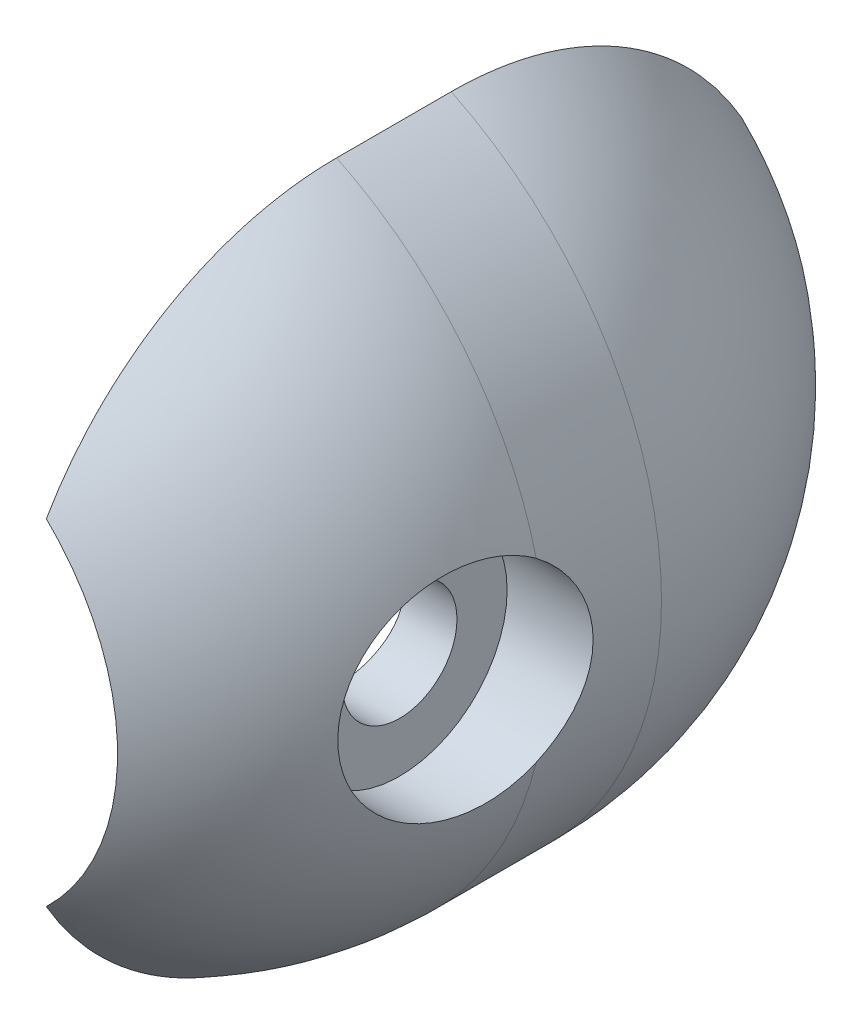
ISO-10303-21;
HEADER;
FILE_DESCRIPTION(('STEP AP214'),'2;1');
FILE_NAME('part.step','',(''),(''),'','','');
FILE_SCHEMA(('AUTOMOTIVE_DESIGN { 1 0 10303 214 1 1 1 1 }'));
ENDSEC;
DATA;
#1=APPLICATION_CONTEXT('core data for automotive mechanical design processes');
#2=APPLICATION_PROTOCOL_DEFINITION('international standard','automotive_design',2000,#1);
#3=PRODUCT_CONTEXT('',#1,'mechanical');
#4=PRODUCT('Part','Part','',(#3));
#5=PRODUCT_RELATED_PRODUCT_CATEGORY('part','',(#4));
#6=PRODUCT_DEFINITION_FORMATION('','',#4);
#7=PRODUCT_DEFINITION_CONTEXT('part definition',#1,'design');
#8=PRODUCT_DEFINITION('design','',#6,#7);
#9=PRODUCT_DEFINITION_SHAPE('','',#8);
#10=(LENGTH_UNIT() NAMED_UNIT(*) SI_UNIT(.MILLI.,.METRE.));
#11=(NAMED_UNIT(*) PLANE_ANGLE_UNIT() SI_UNIT($,.RADIAN.));
#12=(NAMED_UNIT(*) SI_UNIT($,.STERADIAN.) SOLID_ANGLE_UNIT());
#13=UNCERTAINTY_MEASURE_WITH_UNIT(LENGTH_MEASURE(1.E-05),#10,'distance_accuracy_value','');
#14=(GEOMETRIC_REPRESENTATION_CONTEXT(3) GLOBAL_UNCERTAINTY_ASSIGNED_CONTEXT((#13)) GLOBAL_UNIT_ASSIGNED_CONTEXT((#10,
#11,#12)) REPRESENTATION_CONTEXT('',''));
#15=CARTESIAN_POINT('',(0.,0.,0.));
#16=DIRECTION('',(0.,0.,1.));
#17=DIRECTION('',(1.,0.,0.));
#18=AXIS2_PLACEMENT_3D('',#15,#16,#17);
#19=CARTESIAN_POINT('',(0.,0.,-2.));
#20=DIRECTION('',(0.,0.,1.));
#21=DIRECTION('',(1.,0.,0.));
#22=AXIS2_PLACEMENT_3D('',#19,#20,#21);
#23=CYLINDRICAL_SURFACE('',#22,6.5);
#24=CARTESIAN_POINT('',(0.,0.,-2.));
#25=DIRECTION('',(0.,0.,-1.));
#26=DIRECTION('',(-1.,0.,0.));
#27=AXIS2_PLACEMENT_3D('',#24,#25,#26);
#28=CIRCLE('',#27,6.5);
#29=CARTESIAN_POINT('',(2.83218300017888,5.85053326231873,-1.99999999999998));
#30=VERTEX_POINT('',#29);
#31=CARTESIAN_POINT('',(2.83218300017888,-5.85053326231873,-1.99999999999998));
#32=VERTEX_POINT('',#31);
#33=EDGE_CURVE('E91',#30,#32,#28,.T.);
#34=ORIENTED_EDGE('',*,*,#33,.F.);
#35=DIRECTION('',(0.,0.,1.));
#36=VECTOR('',#35,1.);
#37=CARTESIAN_POINT('',(2.83218300017888,5.85053326231873,-2.));
#38=LINE('',#37,#36);
#39=CARTESIAN_POINT('',(2.83218300017887,5.85053326231873,0.));
#40=VERTEX_POINT('',#39);
#41=EDGE_CURVE('E51',#30,#40,#38,.T.);
#42=ORIENTED_EDGE('',*,*,#41,.T.);
#43=CARTESIAN_POINT('',(0.,0.,0.));
#44=DIRECTION('',(0.,0.,-1.));
#45=DIRECTION('',(-1.,0.,0.));
#46=AXIS2_PLACEMENT_3D('',#43,#44,#45);
#47=CIRCLE('',#46,6.5);
#48=CARTESIAN_POINT('',(6.31461700155021,1.54130208711114,0.));
#49=VERTEX_POINT('',#48);
#50=EDGE_CURVE('E101',#40,#49,#47,.T.);
#51=ORIENTED_EDGE('',*,*,#50,.T.);
#52=CARTESIAN_POINT('',(6.31461700155021,1.54130208711114,0.));
#53=CARTESIAN_POINT('',(6.32198857908574,1.51109698103046,-0.0435994876451644));
#54=CARTESIAN_POINT('',(6.32957540148589,1.47907659404713,-0.0858713829253989));
#55=CARTESIAN_POINT('',(6.34496637043963,1.41159648900797,-0.167530981875031));
#56=CARTESIAN_POINT('',(6.35277051299768,1.37613683415506,-0.206918738522475));
#57=CARTESIAN_POINT('',(6.37619220507379,1.26487169735636,-0.320427223621003));
#58=CARTESIAN_POINT('',(6.39181642522165,1.18419021713728,-0.38987851244404));
#59=CARTESIAN_POINT('',(6.42132898699378,1.01201210713663,-0.514298255521196));
#60=CARTESIAN_POINT('',(6.43521590790943,0.920506743351564,-0.569254896682479));
#61=CARTESIAN_POINT('',(6.45968219470522,0.729221433979638,-0.66294222507686));
#62=CARTESIAN_POINT('',(6.47026589895835,0.629452561419527,-0.701694218081978));
#63=CARTESIAN_POINT('',(6.48554087644084,0.441697257129723,-0.756685972032372));
#64=CARTESIAN_POINT('',(6.49092302589285,0.354544113565269,-0.775612679766259));
#65=CARTESIAN_POINT('',(6.49815360593029,0.178267534090456,-0.800914856042572));
#66=CARTESIAN_POINT('',(6.50000145917355,0.089143778677268,-0.807288273957262));
#67=CARTESIAN_POINT('',(6.49999831339637,-0.103037931239378,-0.807283684109613));
#68=CARTESIAN_POINT('',(6.49752591283835,-0.206102613912167,-0.798763380310864));
#69=CARTESIAN_POINT('',(6.48790294183109,-0.409232637572165,-0.764979429276356));
#70=CARTESIAN_POINT('',(6.48075090243528,-0.509297026443797,-0.739710524593954));
#71=CARTESIAN_POINT('',(6.46255614337027,-0.703469529260469,-0.673339932177493));
#72=CARTESIAN_POINT('',(6.45151916567931,-0.797586193155803,-0.632261602612253));
#73=CARTESIAN_POINT('',(6.42670450373198,-0.977619468327088,-0.535512900806938));
#74=CARTESIAN_POINT('',(6.41292602506288,-1.06353369205433,-0.479838297473228));
#75=CARTESIAN_POINT('',(6.38481462979937,-1.22072827422579,-0.358734233247323));
#76=CARTESIAN_POINT('',(6.37055018947306,-1.292543952299,-0.293981177312349));
#77=CARTESIAN_POINT('',(6.34215720405847,-1.42537265373043,-0.154276324129979));
#78=CARTESIAN_POINT('',(6.32802856937644,-1.48639333843161,-0.0793318272324476));
#79=CARTESIAN_POINT('',(6.31461700155021,-1.54130208711113,0.));
#80=B_SPLINE_CURVE_WITH_KNOTS('',3,(#52,#53,#54,#55,#56,#57,#58,#59,#60,#61,#62,#63,#64,#65,#66,
#67,#68,#69,#70,#71,#72,#73,#74,#75,#76,#77,#78,#79),.UNSPECIFIED.,.F.,.F.,(4,2,2,2,2,2,2,2,2,2,
2,2,2,4),(0.,0.160548845477456,0.321094741131677,0.642239936845833,0.963646061734351,
1.2846282649313,1.55173182664302,1.81887901712204,2.12766437771378,2.43654671308545,
2.74497442104067,3.05349163349524,3.34559820878922,3.6374966333292),.UNSPECIFIED.);
#81=CARTESIAN_POINT('',(6.31461700155021,-1.54130208711114,0.));
#82=VERTEX_POINT('',#81);
#83=EDGE_CURVE('E113',#49,#82,#80,.T.);
#84=ORIENTED_EDGE('',*,*,#83,.T.);
#85=CARTESIAN_POINT('',(2.83218300017887,-5.85053326231873,0.));
#86=VERTEX_POINT('',#85);
#87=EDGE_CURVE('E94',#82,#86,#47,.T.);
#88=ORIENTED_EDGE('',*,*,#87,.T.);
#89=DIRECTION('',(0.,0.,1.));
#90=VECTOR('',#89,1.);
#91=CARTESIAN_POINT('',(2.83218300017888,-5.85053326231873,-2.));
#92=LINE('',#91,#90);
#93=EDGE_CURVE('E81',#86,#32,#92,.F.);
#94=ORIENTED_EDGE('',*,*,#93,.T.);
#95=EDGE_LOOP('',(#34,#42,#51,#84,#88,#94));
#96=FACE_BOUND('',#95,.T.);
#97=ADVANCED_FACE('F35',(#96),#23,.T.);
#98=CARTESIAN_POINT('',(2.5,0.,1.06771385505056));
#99=DIRECTION('',(1.,0.,0.));
#100=DIRECTION('',(0.,0.,-1.));
#101=AXIS2_PLACEMENT_3D('',#98,#99,#100);
#102=CYLINDRICAL_SURFACE('',#101,1.);
#103=CARTESIAN_POINT('',(4.075,0.,0.067713855050556));
#104=CARTESIAN_POINT('',(4.07499904475018,0.0552835301018704,0.0677154645149668));
#105=CARTESIAN_POINT('',(4.07386374935255,0.110585249922706,0.0723136909456335));
#106=CARTESIAN_POINT('',(4.06944477976684,0.219605916835804,0.0905588749120229));
#107=CARTESIAN_POINT('',(4.06615983891691,0.273323911215019,0.104211167549513));
#108=CARTESIAN_POINT('',(4.05780564539782,0.377586842868677,0.140101740474629));
#109=CARTESIAN_POINT('',(4.05273849353395,0.428135433816925,0.162329914803333));
#110=CARTESIAN_POINT('',(4.04136064399071,0.524785943961525,0.214706243955371));
#111=CARTESIAN_POINT('',(4.0350499155306,0.570887753049979,0.244854594823421));
#112=CARTESIAN_POINT('',(4.02173059298236,0.658253629579914,0.312849306866738));
#113=CARTESIAN_POINT('',(4.01471154881566,0.699416600507309,0.350823526475008));
#114=CARTESIAN_POINT('',(4.0008367452954,0.774857982591311,0.433118166780281));
#115=CARTESIAN_POINT('',(3.99398100380471,0.80913564361893,0.477439278047578));
#116=CARTESIAN_POINT('',(3.98110406600606,0.870304268925302,0.571948750054729));
#117=CARTESIAN_POINT('',(3.97509615667387,0.897082991455841,0.622211730600353));
#118=CARTESIAN_POINT('',(3.96474717054754,0.941772071687814,0.726697030495582));
#119=CARTESIAN_POINT('',(3.9604058379414,0.959683790556507,0.780918740676171));
#120=CARTESIAN_POINT('',(3.95398881132489,0.985787189597801,0.890672916500155));
#121=CARTESIAN_POINT('',(3.95187090727802,0.994160226268956,0.946159724636663));
#122=CARTESIAN_POINT('',(3.9500141248854,1.00151333263062,1.05778777165738));
#123=CARTESIAN_POINT('',(3.95027487446489,1.00049487136165,1.11392890681809));
#124=CARTESIAN_POINT('',(3.95310795249312,0.98923878083042,1.22388862736974));
#125=CARTESIAN_POINT('',(3.95562630810271,0.979216397414509,1.27773085330313));
#126=CARTESIAN_POINT('',(3.96260493516141,0.950579960761466,1.38294538469551));
#127=CARTESIAN_POINT('',(3.96706534044611,0.931965315386612,1.43431751965814));
#128=CARTESIAN_POINT('',(3.97747559069128,0.886487155417108,1.53371508048623));
#129=CARTESIAN_POINT('',(3.98343956470394,0.859544809406126,1.58170289612285));
#130=CARTESIAN_POINT('',(3.99617688254056,0.798231217391749,1.67255395434461));
#131=CARTESIAN_POINT('',(4.00295036313516,0.763858715226451,1.71541632850355));
#132=CARTESIAN_POINT('',(4.01677142420201,0.687541771059452,1.79603422075633));
#133=CARTESIAN_POINT('',(4.02382142634195,0.645415464104054,1.83361737030412));
#134=CARTESIAN_POINT('',(4.03723334707441,0.555374251204761,1.90121774868632));
#135=CARTESIAN_POINT('',(4.04359524612703,0.507459180960462,1.93123476269914));
#136=CARTESIAN_POINT('',(4.05494395884058,0.406960170642944,1.98291082192826));
#137=CARTESIAN_POINT('',(4.05992629007302,0.354361728438865,2.00454271155107));
#138=CARTESIAN_POINT('',(4.0679218145329,0.246125732302644,2.03861003377043));
#139=CARTESIAN_POINT('',(4.07093537029248,0.190488739937717,2.05104715955487));
#140=CARTESIAN_POINT('',(4.07460046451808,0.0792294279390113,2.06611061893912));
#141=CARTESIAN_POINT('',(4.07530853028364,0.0236407191300542,2.0689717911206));
#142=CARTESIAN_POINT('',(4.07444346237016,-0.0872210490107458,2.06544504895129));
#143=CARTESIAN_POINT('',(4.07287052606975,-0.142494135238414,2.05905793486909));
#144=CARTESIAN_POINT('',(4.06765633361633,-0.250345483336205,2.03740971041497));
#145=CARTESIAN_POINT('',(4.06404477700803,-0.302950872960277,2.02227595112608));
#146=CARTESIAN_POINT('',(4.0551598540691,-0.404874076895213,1.98370885260416));
#147=CARTESIAN_POINT('',(4.04988632353918,-0.454191565785354,1.96027469328192));
#148=CARTESIAN_POINT('',(4.03812633172316,-0.549079104527889,1.90531163546201));
#149=CARTESIAN_POINT('',(4.03162053490662,-0.594569932821025,1.87365020530905));
#150=CARTESIAN_POINT('',(4.01814941968771,-0.679676385489599,1.80330153009682));
#151=CARTESIAN_POINT('',(4.01118402515304,-0.719291032928664,1.76461311914957));
#152=CARTESIAN_POINT('',(3.99737651663293,-0.792482408614201,1.68022007605867));
#153=CARTESIAN_POINT('',(3.99054118482852,-0.825894695171926,1.63437148578334));
#154=CARTESIAN_POINT('',(3.97795170826798,-0.884549988034678,1.53757876905249));
#155=CARTESIAN_POINT('',(3.97219751522239,-0.909793359243654,1.48663487033659));
#156=CARTESIAN_POINT('',(3.96248421676639,-0.951207928156029,1.38137343785624));
#157=CARTESIAN_POINT('',(3.95851450875033,-0.967432849455995,1.32707807048914));
#158=CARTESIAN_POINT('',(3.95280777059345,-0.990494576318383,1.21641850147068));
#159=CARTESIAN_POINT('',(3.95107027330792,-0.997333346183197,1.16005473522278));
#160=CARTESIAN_POINT('',(3.95005935878647,-1.00132885168518,1.04852914435439));
#161=CARTESIAN_POINT('',(3.95071914101134,-0.998748055709032,0.993377175055419));
#162=CARTESIAN_POINT('',(3.95427452000623,-0.984576231847544,0.88432050110317));
#163=CARTESIAN_POINT('',(3.9571700749741,-0.972985372422983,0.830415773149678));
#164=CARTESIAN_POINT('',(3.96483420825711,-0.941263351126785,0.72565720383527));
#165=CARTESIAN_POINT('',(3.96959235221481,-0.921179716936169,0.67478815500449));
#166=CARTESIAN_POINT('',(3.98044736418328,-0.873080161099943,0.577106029792388));
#167=CARTESIAN_POINT('',(3.98654441106131,-0.845063179474537,0.530293496497103));
#168=CARTESIAN_POINT('',(3.99958214253141,-0.781062025197345,0.440780879159474));
#169=CARTESIAN_POINT('',(4.00654020842772,-0.744894950640163,0.39821407828537));
#170=CARTESIAN_POINT('',(4.02041032397938,-0.665978944808126,0.319668270504663));
#171=CARTESIAN_POINT('',(4.02732236237921,-0.623228461142327,0.283690821782497));
#172=CARTESIAN_POINT('',(4.04046400088,-0.531467922173732,0.218740505460297));
#173=CARTESIAN_POINT('',(4.04667975001027,-0.482362495180675,0.189899370710869));
#174=CARTESIAN_POINT('',(4.05758360710443,-0.37985293822379,0.140927399456526));
#175=CARTESIAN_POINT('',(4.06227283872146,-0.326452006409451,0.120790152518497));
#176=CARTESIAN_POINT('',(4.06887943619084,-0.227601118129441,0.0928812904024764));
#177=CARTESIAN_POINT('',(4.07115912914393,-0.182632950041633,0.0834635154046566));
#178=CARTESIAN_POINT('',(4.07421975535349,-0.0917806576171333,0.0708793474530807));
#179=CARTESIAN_POINT('',(4.07500079305204,-0.0458965973346606,0.0677125188670697));
#180=CARTESIAN_POINT('',(4.075,0.,0.067713855050556));
#181=B_SPLINE_CURVE_WITH_KNOTS('',3,(#103,#104,#105,#106,#107,#108,#109,#110,#111,#112,#113,
#114,#115,#116,#117,#118,#119,#120,#121,#122,#123,#124,#125,#126,#127,#128,#129,#130,#131,#132,
#133,#134,#135,#136,#137,#138,#139,#140,#141,#142,#143,#144,#145,#146,#147,#148,#149,#150,#151,
#152,#153,#154,#155,#156,#157,#158,#159,#160,#161,#162,#163,#164,#165,#166,#167,#168,#169,#170,
#171,#172,#173,#174,#175,#176,#177,#178,#179,#180),.UNSPECIFIED.,.T.,.F.,(4,2,2,2,2,2,2,2,2,2,2,
2,2,2,2,2,2,2,2,2,2,2,2,2,2,2,2,2,2,2,2,2,2,2,2,2,2,2,4),(0.,0.165682427165242,
0.331462569423854,0.497047947432195,0.662637424490257,0.831184046450722,0.999749020993322,
1.17071646587586,1.34165765752597,1.50929151016763,1.6768991415668,1.84060357131944,
2.00431928448554,2.16963484869018,2.33497838347166,2.50485812547469,2.67474269024707,
2.8451729265034,3.01557177072571,3.18175991464421,3.34793367890375,3.51174681343416,
3.67557613740997,3.84222860633258,4.00890875085316,4.17952008091962,4.35012378875693,
4.51969999643121,4.68924071034967,4.85409383247401,5.01894387242059,5.18288333094989,
5.34684470388249,5.51493591739904,5.68306682827773,5.85410203998568,6.02501106833324,
6.16257083761979,6.3001210199439),.UNSPECIFIED.);
#182=CARTESIAN_POINT('',(4.075,0.,0.067713855050556));
#183=VERTEX_POINT('',#182);
#184=EDGE_CURVE('E98',#183,#183,#181,.T.);
#185=ORIENTED_EDGE('',*,*,#184,.F.);
#186=EDGE_LOOP('',(#185));
#187=FACE_BOUND('',#186,.T.);
#188=CARTESIAN_POINT('',(5.,0.,1.06771385505056));
#189=DIRECTION('',(1.,0.,0.));
#190=DIRECTION('',(0.,0.,-1.));
#191=AXIS2_PLACEMENT_3D('',#188,#189,#190);
#192=CIRCLE('',#191,1.);
#193=CARTESIAN_POINT('',(5.,0.,0.067713855050556));
#194=VERTEX_POINT('',#193);
#195=EDGE_CURVE('E118',#194,#194,#192,.F.);
#196=ORIENTED_EDGE('',*,*,#195,.F.);
#197=EDGE_LOOP('',(#196));
#198=FACE_BOUND('',#197,.T.);
#199=ADVANCED_FACE('F123',(#187,#198),#102,.F.);
#200=CARTESIAN_POINT('',(0.,0.,0.));
#201=DIRECTION('',(0.,1.,0.));
#202=DIRECTION('',(-1.,0.,0.));
#203=AXIS2_PLACEMENT_3D('',#200,#201,#202);
#204=SPHERICAL_SURFACE('',#203,6.5);
#205=ORIENTED_EDGE('',*,*,#50,.F.);
#206=CARTESIAN_POINT('',(2.83218300017888,0.,0.));
#207=DIRECTION('',(1.,0.,0.));
#208=DIRECTION('',(0.,0.,-1.));
#209=AXIS2_PLACEMENT_3D('',#206,#207,#208);
#210=CIRCLE('',#209,5.85053326231872);
#211=CARTESIAN_POINT('',(2.83218300017889,2.92990860838653,5.06402754731845));
#212=VERTEX_POINT('',#211);
#213=EDGE_CURVE('E140',#40,#212,#210,.T.);
#214=ORIENTED_EDGE('',*,*,#213,.T.);
#215=CARTESIAN_POINT('',(0.,0.,5.06402754731844));
#216=DIRECTION('',(0.,0.,-1.));
#217=DIRECTION('',(-1.,0.,0.));
#218=AXIS2_PLACEMENT_3D('',#215,#216,#217);
#219=CIRCLE('',#218,4.075);
#220=CARTESIAN_POINT('',(2.83218300017889,-2.92990860838653,5.06402754731845));
#221=VERTEX_POINT('',#220);
#222=EDGE_CURVE('E97',#212,#221,#219,.T.);
#223=ORIENTED_EDGE('',*,*,#222,.T.);
#224=EDGE_CURVE('E144',#221,#86,#210,.T.);
#225=ORIENTED_EDGE('',*,*,#224,.T.);
#226=ORIENTED_EDGE('',*,*,#87,.F.);
#227=CARTESIAN_POINT('',(6.31465081867629,-1.54116352091235,-0.000200000000045389));
#228=CARTESIAN_POINT('',(6.3072205889043,-1.57161291025704,0.0437438827490355));
#229=CARTESIAN_POINT('',(6.29956506274579,-1.60014902096794,0.0889421867019175));
#230=CARTESIAN_POINT('',(6.28384959295751,-1.65323542182469,0.181548616474897));
#231=CARTESIAN_POINT('',(6.27578969171651,-1.67778612860396,0.228956510637042));
#232=CARTESIAN_POINT('',(6.25110094182018,-1.74514657739484,0.373880293439309));
#233=CARTESIAN_POINT('',(6.23393504641126,-1.78177913563805,0.474262075144893));
#234=CARTESIAN_POINT('',(6.19866800023585,-1.83747606074835,0.679589438150064));
#235=CARTESIAN_POINT('',(6.18056666959578,-1.85653703542512,0.784535896566281));
#236=CARTESIAN_POINT('',(6.14391505632658,-1.87663856235421,0.996067974157869));
#237=CARTESIAN_POINT('',(6.12536480212969,-1.87768025286859,1.10265348936977));
#238=CARTESIAN_POINT('',(6.08821585245483,-1.86167480861146,1.31512892095373));
#239=CARTESIAN_POINT('',(6.06961756232046,-1.84451622309571,1.42101050975517));
#240=CARTESIAN_POINT('',(6.03302111686598,-1.79239096301263,1.62842273621022));
#241=CARTESIAN_POINT('',(6.01502304139275,-1.75742192910168,1.72995279548595));
#242=CARTESIAN_POINT('',(5.98017622750199,-1.67061379102958,1.92569565624623));
#243=CARTESIAN_POINT('',(5.96332705239921,-1.61878114027878,2.01991123979605));
#244=CARTESIAN_POINT('',(5.93130112657184,-1.49963370362447,2.19830039133615));
#245=CARTESIAN_POINT('',(5.91612421659549,-1.43232039385016,2.28247491561136));
#246=CARTESIAN_POINT('',(5.8880832632197,-1.2847974958478,2.43747818631249));
#247=CARTESIAN_POINT('',(5.87519779988109,-1.20472224921303,2.50843086431527));
#248=CARTESIAN_POINT('',(5.85199741869102,-1.03343623455246,2.63584157456956));
#249=CARTESIAN_POINT('',(5.8416823222268,-0.942226240927963,2.69230061398069));
#250=CARTESIAN_POINT('',(5.82412924117725,-0.752778994146286,2.78819211521569));
#251=CARTESIAN_POINT('',(5.81684594053383,-0.654672930797368,2.82787547333601));
#252=CARTESIAN_POINT('',(5.8053909749714,-0.45302246032442,2.89022036554466));
#253=CARTESIAN_POINT('',(5.80121902168733,-0.349478558141063,2.91288347710018));
#254=CARTESIAN_POINT('',(5.79617532590578,-0.141414602206592,2.94027552516786));
#255=CARTESIAN_POINT('',(5.79525915908175,-0.0369273492715338,2.94524587620141));
#256=CARTESIAN_POINT('',(5.79663632689522,0.171398033623038,2.9377700763749));
#257=CARTESIAN_POINT('',(5.79892952708442,0.27523619059174,2.92532465510456));
#258=CARTESIAN_POINT('',(5.80662283571731,0.478792649642255,2.88351301819295));
#259=CARTESIAN_POINT('',(5.81200769302334,0.578528618318865,2.85422986200828));
#260=CARTESIAN_POINT('',(5.82568209575377,0.771633148517841,2.7797065594464));
#261=CARTESIAN_POINT('',(5.83397171377353,0.865001550833261,2.73446601426433));
#262=CARTESIAN_POINT('',(5.85323260987349,1.04338481719538,2.62905120817034));
#263=CARTESIAN_POINT('',(5.86422053679937,1.12834303962543,2.56878419561623));
#264=CARTESIAN_POINT('',(5.88848468081099,1.28695069478689,2.43524180924909));
#265=CARTESIAN_POINT('',(5.90176101769813,1.36059953507474,2.36196575438883));
#266=CARTESIAN_POINT('',(5.93038291720686,1.49562385574213,2.20337760634622));
#267=CARTESIAN_POINT('',(5.94575514073672,1.55681058621445,2.11790964186561));
#268=CARTESIAN_POINT('',(5.97794462356239,1.66399536958218,1.93817134140073));
#269=CARTESIAN_POINT('',(5.99476205583844,1.70999160109323,1.8438999515976));
#270=CARTESIAN_POINT('',(6.02960719245264,1.78619400886702,1.64769465386814));
#271=CARTESIAN_POINT('',(6.04764936266288,1.81615064814209,1.54566636320895));
#272=CARTESIAN_POINT('',(6.08418494557441,1.85842276163942,1.33809967688933));
#273=CARTESIAN_POINT('',(6.10267836239249,1.87073807485639,1.23256124920229));
#274=CARTESIAN_POINT('',(6.13977062333244,1.87743494084823,1.01991358787414));
#275=CARTESIAN_POINT('',(6.15836882970036,1.87164722675916,0.912798905012369));
#276=CARTESIAN_POINT('',(6.19497757023698,1.84189872352663,0.701019300012855));
#277=CARTESIAN_POINT('',(6.2129881921177,1.81794065983931,0.596354012905597));
#278=CARTESIAN_POINT('',(6.24548529747532,1.75704259120122,0.406722744155957));
#279=CARTESIAN_POINT('',(6.26011321337551,1.72237577418266,0.321043582228424));
#280=CARTESIAN_POINT('',(6.2882736299403,1.6407818223383,0.155567994149425));
#281=CARTESIAN_POINT('',(6.30180633697054,1.59385700431457,0.0757704600014301));
#282=CARTESIAN_POINT('',(6.31465081867629,1.54116352091235,-0.000200000000045501));
#283=B_SPLINE_CURVE_WITH_KNOTS('',3,(#227,#228,#229,#230,#231,#232,#233,#234,#235,#236,#237,
#238,#239,#240,#241,#242,#243,#244,#245,#246,#247,#248,#249,#250,#251,#252,#253,#254,#255,#256,
#257,#258,#259,#260,#261,#262,#263,#264,#265,#266,#267,#268,#269,#270,#271,#272,#273,#274,#275,
#276,#277,#278,#279,#280,#281,#282),.UNSPECIFIED.,.F.,.F.,(4,2,2,2,2,2,2,2,2,2,2,2,2,2,2,2,2,2,
2,2,2,2,2,2,2,2,2,4),(0.,0.16182685696161,0.323636785662587,0.646654214700187,0.969733989130292,
1.29279335482563,1.61784248160664,1.94293467873088,2.26790261481718,2.59283957703337,
2.91455804064845,3.2362541420657,3.55295239912394,3.86962130039237,4.18195238711221,
4.49427038990303,4.80506080624533,5.11585899036945,5.42862526197319,5.74140791229614,
6.05862374972108,6.37587760843668,6.6979334408337,7.01999221248629,7.34507126841029,
7.67010157383965,7.94985665406778,8.22955889788351),.UNSPECIFIED.);
#284=EDGE_CURVE('E104',#82,#49,#283,.T.);
#285=ORIENTED_EDGE('',*,*,#284,.T.);
#286=EDGE_LOOP('',(#205,#214,#223,#225,#226,#285));
#287=FACE_BOUND('',#286,.T.);
#288=ADVANCED_FACE('F37',(#287),#204,.T.);
#289=CARTESIAN_POINT('',(0.,0.,6.50000000000004));
#290=DIRECTION('',(0.,0.,-1.));
#291=DIRECTION('',(-1.,0.,0.));
#292=AXIS2_PLACEMENT_3D('',#289,#290,#291);
#293=CYLINDRICAL_SURFACE('',#292,4.075);
#294=ORIENTED_EDGE('',*,*,#184,.T.);
#295=EDGE_LOOP('',(#294));
#296=FACE_BOUND('',#295,.T.);
#297=CARTESIAN_POINT('',(0.,0.,-7.06402754731844));
#298=DIRECTION('',(0.,0.,1.));
#299=DIRECTION('',(1.,0.,0.));
#300=AXIS2_PLACEMENT_3D('',#297,#298,#299);
#301=CIRCLE('',#300,4.075);
#302=CARTESIAN_POINT('',(2.83218300017888,-2.92990860838658,-7.06402754731844));
#303=VERTEX_POINT('',#302);
#304=CARTESIAN_POINT('',(2.83218300017888,2.92990860838658,-7.06402754731844));
#305=VERTEX_POINT('',#304);
#306=EDGE_CURVE('E87',#303,#305,#301,.T.);
#307=ORIENTED_EDGE('',*,*,#306,.F.);
#308=DIRECTION('',(0.,0.,-1.));
#309=VECTOR('',#308,1.);
#310=CARTESIAN_POINT('',(2.83218300017888,-2.92990860838653,6.50000000000004));
#311=LINE('',#310,#309);
#312=EDGE_CURVE('E58',#303,#221,#311,.F.);
#313=ORIENTED_EDGE('',*,*,#312,.T.);
#314=ORIENTED_EDGE('',*,*,#222,.F.);
#315=DIRECTION('',(0.,0.,-1.));
#316=VECTOR('',#315,1.);
#317=CARTESIAN_POINT('',(2.83218300017888,2.92990860838653,6.50000000000004));
#318=LINE('',#317,#316);
#319=EDGE_CURVE('E138',#212,#305,#318,.T.);
#320=ORIENTED_EDGE('',*,*,#319,.T.);
#321=EDGE_LOOP('',(#307,#313,#314,#320));
#322=FACE_BOUND('',#321,.T.);
#323=ADVANCED_FACE('F120',(#296,#322),#293,.F.);
#324=CARTESIAN_POINT('',(5.,0.,1.06771385505056));
#325=DIRECTION('',(1.,0.,0.));
#326=DIRECTION('',(0.,0.,-1.));
#327=AXIS2_PLACEMENT_3D('',#324,#325,#326);
#328=CYLINDRICAL_SURFACE('',#327,1.875);
#329=CARTESIAN_POINT('',(5.,0.,1.06771385505056));
#330=DIRECTION('',(1.,0.,0.));
#331=DIRECTION('',(0.,0.,-1.));
#332=AXIS2_PLACEMENT_3D('',#329,#330,#331);
#333=CIRCLE('',#332,1.875);
#334=CARTESIAN_POINT('',(5.,0.,-0.807286144949444));
#335=VERTEX_POINT('',#334);
#336=EDGE_CURVE('E142',#335,#335,#333,.T.);
#337=ORIENTED_EDGE('',*,*,#336,.F.);
#338=EDGE_LOOP('',(#337));
#339=FACE_BOUND('',#338,.T.);
#340=ORIENTED_EDGE('',*,*,#83,.F.);
#341=ORIENTED_EDGE('',*,*,#284,.F.);
#342=EDGE_LOOP('',(#340,#341));
#343=FACE_BOUND('',#342,.T.);
#344=ADVANCED_FACE('F127',(#339,#343),#328,.F.);
#345=CARTESIAN_POINT('',(5.,0.,1.06771385505056));
#346=DIRECTION('',(1.,0.,0.));
#347=DIRECTION('',(0.,0.,-1.));
#348=AXIS2_PLACEMENT_3D('',#345,#346,#347);
#349=PLANE('',#348);
#350=ORIENTED_EDGE('',*,*,#336,.T.);
#351=EDGE_LOOP('',(#350));
#352=FACE_BOUND('',#351,.T.);
#353=ORIENTED_EDGE('',*,*,#195,.T.);
#354=EDGE_LOOP('',(#353));
#355=FACE_BOUND('',#354,.T.);
#356=ADVANCED_FACE('F158',(#352,#355),#349,.T.);
#357=CARTESIAN_POINT('',(0.,0.,-2.));
#358=DIRECTION('',(0.,1.,0.));
#359=DIRECTION('',(1.,0.,0.));
#360=AXIS2_PLACEMENT_3D('',#357,#358,#359);
#361=SPHERICAL_SURFACE('',#360,6.5);
#362=ORIENTED_EDGE('',*,*,#306,.T.);
#363=CARTESIAN_POINT('',(2.83218300017888,0.,-2.));
#364=DIRECTION('',(1.,0.,0.));
#365=DIRECTION('',(0.,0.,-1.));
#366=AXIS2_PLACEMENT_3D('',#363,#364,#365);
#367=CIRCLE('',#366,5.85053326231873);
#368=EDGE_CURVE('E11',#305,#30,#367,.T.);
#369=ORIENTED_EDGE('',*,*,#368,.T.);
#370=ORIENTED_EDGE('',*,*,#33,.T.);
#371=EDGE_CURVE('E40',#32,#303,#367,.T.);
#372=ORIENTED_EDGE('',*,*,#371,.T.);
#373=EDGE_LOOP('',(#362,#369,#370,#372));
#374=FACE_BOUND('',#373,.T.);
#375=ADVANCED_FACE('F96',(#374),#361,.T.);
#376=CARTESIAN_POINT('',(2.83218300017888,-6.5,-12.5215252543853));
#377=DIRECTION('',(1.,0.,0.));
#378=DIRECTION('',(0.,0.,-1.));
#379=AXIS2_PLACEMENT_3D('',#376,#377,#378);
#380=PLANE('',#379);
#381=ORIENTED_EDGE('',*,*,#312,.F.);
#382=ORIENTED_EDGE('',*,*,#371,.F.);
#383=ORIENTED_EDGE('',*,*,#93,.F.);
#384=ORIENTED_EDGE('',*,*,#224,.F.);
#385=EDGE_LOOP('',(#381,#382,#383,#384));
#386=FACE_BOUND('',#385,.T.);
#387=ADVANCED_FACE('F80',(#386),#380,.F.);
#388=ORIENTED_EDGE('',*,*,#41,.F.);
#389=ORIENTED_EDGE('',*,*,#368,.F.);
#390=ORIENTED_EDGE('',*,*,#319,.F.);
#391=ORIENTED_EDGE('',*,*,#213,.F.);
#392=EDGE_LOOP('',(#388,#389,#390,#391));
#393=FACE_BOUND('',#392,.T.);
#394=ADVANCED_FACE('F224',(#393),#380,.F.);
#395=CLOSED_SHELL('',(#97,#199,#288,#323,#344,#356,#375,#387,#394));
#396=MANIFOLD_SOLID_BREP('B2',#395);
#397=ADVANCED_BREP_SHAPE_REPRESENTATION('',(#18,#396),#14);
#398=SHAPE_DEFINITION_REPRESENTATION(#9,#397);
ENDSEC;
END-ISO-10303-21;
